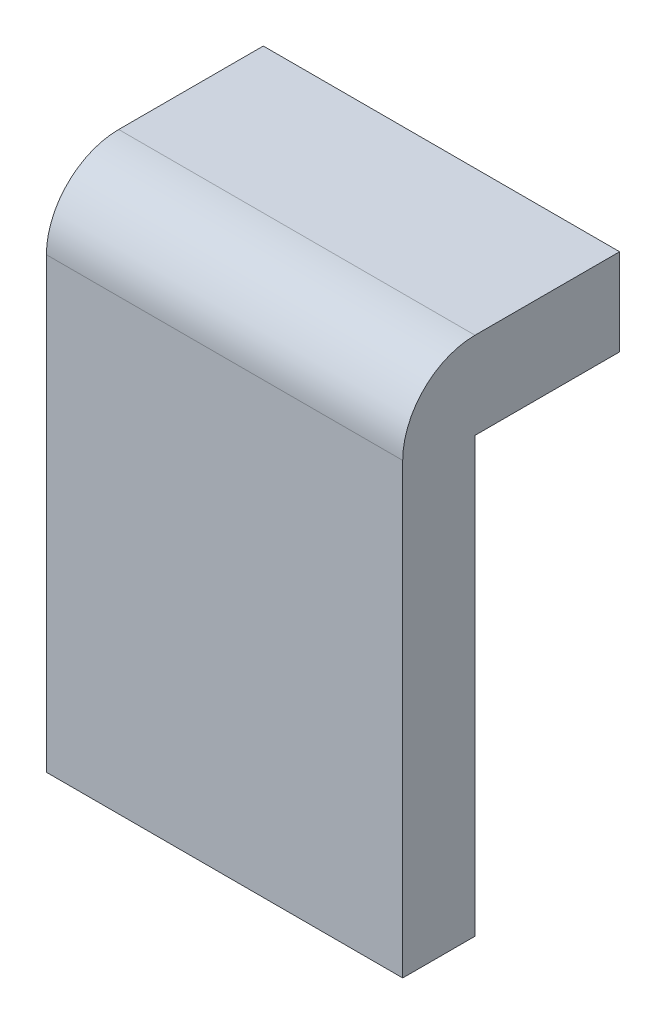
ISO-10303-21;
HEADER;
FILE_DESCRIPTION(('STEP AP214'),'2;1');
FILE_NAME('part.step','',(''),(''),'','','');
FILE_SCHEMA(('AUTOMOTIVE_DESIGN { 1 0 10303 214 1 1 1 1 }'));
ENDSEC;
DATA;
#1=APPLICATION_CONTEXT('core data for automotive mechanical design processes');
#2=APPLICATION_PROTOCOL_DEFINITION('international standard','automotive_design',2000,#1);
#3=PRODUCT_CONTEXT('',#1,'mechanical');
#4=PRODUCT('Part','Part','',(#3));
#5=PRODUCT_RELATED_PRODUCT_CATEGORY('part','',(#4));
#6=PRODUCT_DEFINITION_FORMATION('','',#4);
#7=PRODUCT_DEFINITION_CONTEXT('part definition',#1,'design');
#8=PRODUCT_DEFINITION('design','',#6,#7);
#9=PRODUCT_DEFINITION_SHAPE('','',#8);
#10=(LENGTH_UNIT() NAMED_UNIT(*) SI_UNIT(.MILLI.,.METRE.));
#11=(NAMED_UNIT(*) PLANE_ANGLE_UNIT() SI_UNIT($,.RADIAN.));
#12=(NAMED_UNIT(*) SI_UNIT($,.STERADIAN.) SOLID_ANGLE_UNIT());
#13=UNCERTAINTY_MEASURE_WITH_UNIT(LENGTH_MEASURE(1.E-05),#10,'distance_accuracy_value','');
#14=(GEOMETRIC_REPRESENTATION_CONTEXT(3) GLOBAL_UNCERTAINTY_ASSIGNED_CONTEXT((#13)) GLOBAL_UNIT_ASSIGNED_CONTEXT((#10,
#11,#12)) REPRESENTATION_CONTEXT('',''));
#15=CARTESIAN_POINT('',(0.,0.,0.));
#16=DIRECTION('',(0.,0.,1.));
#17=DIRECTION('',(1.,0.,0.));
#18=AXIS2_PLACEMENT_3D('',#15,#16,#17);
#19=CARTESIAN_POINT('',(-8.34906661620967,8.30000000000001,12.2546737770755));
#20=DIRECTION('',(0.,0.,1.));
#21=DIRECTION('',(0.,-1.,0.));
#22=AXIS2_PLACEMENT_3D('',#19,#20,#21);
#23=PLANE('',#22);
#24=DIRECTION('',(1.,0.,0.));
#25=VECTOR('',#24,1.);
#26=CARTESIAN_POINT('',(-15.8147962412963,6.80000000000003,12.2546737770755));
#27=LINE('',#26,#25);
#28=CARTESIAN_POINT('',(-5.89065244584898,6.80000000000003,12.2546737770755));
#29=VERTEX_POINT('',#28);
#30=CARTESIAN_POINT('',(-4.65850168940825,6.80000000000003,12.2546737770755));
#31=VERTEX_POINT('',#30);
#32=EDGE_CURVE('E113',#29,#31,#27,.T.);
#33=ORIENTED_EDGE('',*,*,#32,.F.);
#34=DIRECTION('',(0.,1.,0.));
#35=VECTOR('',#34,1.);
#36=CARTESIAN_POINT('',(-5.89065244584898,5.35753839337147,12.2546737770755));
#37=LINE('',#36,#35);
#38=CARTESIAN_POINT('',(-5.89065244584898,8.30000000000001,12.2546737770755));
#39=VERTEX_POINT('',#38);
#40=EDGE_CURVE('E148',#39,#29,#37,.F.);
#41=ORIENTED_EDGE('',*,*,#40,.F.);
#42=DIRECTION('',(1.,0.,0.));
#43=VECTOR('',#42,1.);
#44=CARTESIAN_POINT('',(-8.34906661620967,8.30000000000001,12.2546737770755));
#45=LINE('',#44,#43);
#46=CARTESIAN_POINT('',(-4.65850168940825,8.30000000000001,12.2546737770755));
#47=VERTEX_POINT('',#46);
#48=EDGE_CURVE('E133',#39,#47,#45,.T.);
#49=ORIENTED_EDGE('',*,*,#48,.T.);
#50=DIRECTION('',(0.,1.,0.));
#51=VECTOR('',#50,1.);
#52=CARTESIAN_POINT('',(-4.65850168940825,5.35753839337147,12.2546737770755));
#53=LINE('',#52,#51);
#54=EDGE_CURVE('E105',#31,#47,#53,.T.);
#55=ORIENTED_EDGE('',*,*,#54,.F.);
#56=EDGE_LOOP('',(#33,#41,#49,#55));
#57=FACE_BOUND('',#56,.T.);
#58=ADVANCED_FACE('F17',(#57),#23,.F.);
#59=CARTESIAN_POINT('',(-8.34906661620967,8.30000000000001,11.7546737770755));
#60=DIRECTION('',(0.,1.,0.));
#61=DIRECTION('',(0.,0.,1.));
#62=AXIS2_PLACEMENT_3D('',#59,#60,#61);
#63=PLANE('',#62);
#64=ORIENTED_EDGE('',*,*,#48,.F.);
#65=DIRECTION('',(0.,0.,1.));
#66=VECTOR('',#65,1.);
#67=CARTESIAN_POINT('',(-5.89065244584898,8.30000000000001,12.5046737770755));
#68=LINE('',#67,#66);
#69=CARTESIAN_POINT('',(-5.89065244584898,8.30000000000001,11.7546737770755));
#70=VERTEX_POINT('',#69);
#71=EDGE_CURVE('E153',#70,#39,#68,.T.);
#72=ORIENTED_EDGE('',*,*,#71,.F.);
#73=DIRECTION('',(1.,0.,0.));
#74=VECTOR('',#73,1.);
#75=CARTESIAN_POINT('',(-5.89065244584898,8.30000000000001,11.7546737770755));
#76=LINE('',#75,#74);
#77=CARTESIAN_POINT('',(-4.65850168940825,8.30000000000001,11.7546737770755));
#78=VERTEX_POINT('',#77);
#79=EDGE_CURVE('E124',#78,#70,#76,.F.);
#80=ORIENTED_EDGE('',*,*,#79,.F.);
#81=DIRECTION('',(0.,0.,-1.));
#82=VECTOR('',#81,1.);
#83=CARTESIAN_POINT('',(-4.65850168940825,8.30000000000001,12.5046737770755));
#84=LINE('',#83,#82);
#85=EDGE_CURVE('E129',#47,#78,#84,.T.);
#86=ORIENTED_EDGE('',*,*,#85,.F.);
#87=EDGE_LOOP('',(#64,#72,#80,#86));
#88=FACE_BOUND('',#87,.T.);
#89=ADVANCED_FACE('F175',(#88),#63,.F.);
#90=CARTESIAN_POINT('',(-5.89065244584898,5.35753839337146,11.7546737770755));
#91=DIRECTION('',(0.,0.,-1.));
#92=DIRECTION('',(0.,1.,0.));
#93=AXIS2_PLACEMENT_3D('',#90,#91,#92);
#94=PLANE('',#93);
#95=ORIENTED_EDGE('',*,*,#79,.T.);
#96=DIRECTION('',(0.,1.,0.));
#97=VECTOR('',#96,1.);
#98=CARTESIAN_POINT('',(-5.89065244584898,5.35753839337147,11.7546737770755));
#99=LINE('',#98,#97);
#100=CARTESIAN_POINT('',(-5.89065244584898,8.6,11.7546737770755));
#101=VERTEX_POINT('',#100);
#102=EDGE_CURVE('E119',#101,#70,#99,.F.);
#103=ORIENTED_EDGE('',*,*,#102,.F.);
#104=DIRECTION('',(1.,0.,0.));
#105=VECTOR('',#104,1.);
#106=CARTESIAN_POINT('',(-8.34906661620967,8.6,11.7546737770755));
#107=LINE('',#106,#105);
#108=CARTESIAN_POINT('',(-4.65850168940825,8.6,11.7546737770755));
#109=VERTEX_POINT('',#108);
#110=EDGE_CURVE('E122',#101,#109,#107,.T.);
#111=ORIENTED_EDGE('',*,*,#110,.T.);
#112=DIRECTION('',(0.,1.,0.));
#113=VECTOR('',#112,1.);
#114=CARTESIAN_POINT('',(-4.65850168940825,5.35753839337147,11.7546737770755));
#115=LINE('',#114,#113);
#116=EDGE_CURVE('E97',#78,#109,#115,.T.);
#117=ORIENTED_EDGE('',*,*,#116,.F.);
#118=EDGE_LOOP('',(#95,#103,#111,#117));
#119=FACE_BOUND('',#118,.T.);
#120=ADVANCED_FACE('F172',(#119),#94,.T.);
#121=CARTESIAN_POINT('',(-8.34906661620967,8.6,11.7546737770755));
#122=DIRECTION('',(0.,-1.,0.));
#123=DIRECTION('',(0.,0.,-1.));
#124=AXIS2_PLACEMENT_3D('',#121,#122,#123);
#125=PLANE('',#124);
#126=ORIENTED_EDGE('',*,*,#110,.F.);
#127=DIRECTION('',(0.,0.,1.));
#128=VECTOR('',#127,1.);
#129=CARTESIAN_POINT('',(-5.89065244584898,8.6,12.5046737770755));
#130=LINE('',#129,#128);
#131=CARTESIAN_POINT('',(-5.89065244584898,8.6,12.2546737770755));
#132=VERTEX_POINT('',#131);
#133=EDGE_CURVE('E83',#132,#101,#130,.F.);
#134=ORIENTED_EDGE('',*,*,#133,.F.);
#135=DIRECTION('',(1.,0.,0.));
#136=VECTOR('',#135,1.);
#137=CARTESIAN_POINT('',(-8.34906661620967,8.6,12.2546737770755));
#138=LINE('',#137,#136);
#139=CARTESIAN_POINT('',(-4.65850168940825,8.6,12.2546737770755));
#140=VERTEX_POINT('',#139);
#141=EDGE_CURVE('E79',#140,#132,#138,.F.);
#142=ORIENTED_EDGE('',*,*,#141,.F.);
#143=DIRECTION('',(0.,0.,-1.));
#144=VECTOR('',#143,1.);
#145=CARTESIAN_POINT('',(-4.65850168940825,8.6,12.5046737770755));
#146=LINE('',#145,#144);
#147=EDGE_CURVE('E94',#109,#140,#146,.F.);
#148=ORIENTED_EDGE('',*,*,#147,.F.);
#149=EDGE_LOOP('',(#126,#134,#142,#148));
#150=FACE_BOUND('',#149,.T.);
#151=ADVANCED_FACE('F168',(#150),#125,.F.);
#152=CARTESIAN_POINT('',(-8.34906661620967,8.35,12.2546737770755));
#153=DIRECTION('',(1.,0.,0.));
#154=DIRECTION('',(0.,0.,-1.));
#155=AXIS2_PLACEMENT_3D('',#152,#153,#154);
#156=CYLINDRICAL_SURFACE('',#155,0.249999999999995);
#157=CARTESIAN_POINT('',(-5.89065244584898,8.35,12.2546737770755));
#158=DIRECTION('',(1.,0.,0.));
#159=DIRECTION('',(0.,0.,-1.));
#160=AXIS2_PLACEMENT_3D('',#157,#158,#159);
#161=CIRCLE('',#160,0.249999999999995);
#162=CARTESIAN_POINT('',(-5.89065244584898,8.35,12.5046737770755));
#163=VERTEX_POINT('',#162);
#164=EDGE_CURVE('E20',#163,#132,#161,.F.);
#165=ORIENTED_EDGE('',*,*,#164,.F.);
#166=DIRECTION('',(1.,0.,0.));
#167=VECTOR('',#166,1.);
#168=CARTESIAN_POINT('',(-5.89065244584898,8.35,12.5046737770755));
#169=LINE('',#168,#167);
#170=CARTESIAN_POINT('',(-4.65850168940825,8.35,12.5046737770755));
#171=VERTEX_POINT('',#170);
#172=EDGE_CURVE('E77',#171,#163,#169,.F.);
#173=ORIENTED_EDGE('',*,*,#172,.F.);
#174=CARTESIAN_POINT('',(-4.65850168940825,8.35,12.2546737770755));
#175=DIRECTION('',(1.,0.,0.));
#176=DIRECTION('',(0.,0.,-1.));
#177=AXIS2_PLACEMENT_3D('',#174,#175,#176);
#178=CIRCLE('',#177,0.249999999999995);
#179=EDGE_CURVE('E106',#140,#171,#178,.T.);
#180=ORIENTED_EDGE('',*,*,#179,.F.);
#181=ORIENTED_EDGE('',*,*,#141,.T.);
#182=EDGE_LOOP('',(#165,#173,#180,#181));
#183=FACE_BOUND('',#182,.T.);
#184=ADVANCED_FACE('F74',(#183),#156,.T.);
#185=CARTESIAN_POINT('',(-5.89065244584898,5.35753839337147,12.5046737770755));
#186=DIRECTION('',(-1.,0.,0.));
#187=DIRECTION('',(0.,0.,1.));
#188=AXIS2_PLACEMENT_3D('',#185,#186,#187);
#189=PLANE('',#188);
#190=DIRECTION('',(0.,0.,-1.));
#191=VECTOR('',#190,1.);
#192=CARTESIAN_POINT('',(-5.89065244584898,6.80000000000003,12.5046737770755));
#193=LINE('',#192,#191);
#194=CARTESIAN_POINT('',(-5.89065244584898,6.80000000000003,12.5046737770755));
#195=VERTEX_POINT('',#194);
#196=EDGE_CURVE('E89',#195,#29,#193,.T.);
#197=ORIENTED_EDGE('',*,*,#196,.F.);
#198=DIRECTION('',(0.,-1.,0.));
#199=VECTOR('',#198,1.);
#200=CARTESIAN_POINT('',(-5.89065244584898,5.35753839337147,12.5046737770755));
#201=LINE('',#200,#199);
#202=EDGE_CURVE('E85',#163,#195,#201,.T.);
#203=ORIENTED_EDGE('',*,*,#202,.F.);
#204=ORIENTED_EDGE('',*,*,#164,.T.);
#205=ORIENTED_EDGE('',*,*,#133,.T.);
#206=ORIENTED_EDGE('',*,*,#102,.T.);
#207=ORIENTED_EDGE('',*,*,#71,.T.);
#208=ORIENTED_EDGE('',*,*,#40,.T.);
#209=EDGE_LOOP('',(#197,#203,#204,#205,#206,#207,#208));
#210=FACE_BOUND('',#209,.T.);
#211=ADVANCED_FACE('F86',(#210),#189,.T.);
#212=CARTESIAN_POINT('',(-15.8147962412963,6.80000000000003,12.5046737770755));
#213=DIRECTION('',(0.,-1.,0.));
#214=DIRECTION('',(0.,0.,-1.));
#215=AXIS2_PLACEMENT_3D('',#212,#213,#214);
#216=PLANE('',#215);
#217=DIRECTION('',(1.,0.,0.));
#218=VECTOR('',#217,1.);
#219=CARTESIAN_POINT('',(-5.89065244584898,6.80000000000003,12.5046737770755));
#220=LINE('',#219,#218);
#221=CARTESIAN_POINT('',(-4.65850168940825,6.80000000000003,12.5046737770755));
#222=VERTEX_POINT('',#221);
#223=EDGE_CURVE('E26',#195,#222,#220,.T.);
#224=ORIENTED_EDGE('',*,*,#223,.F.);
#225=ORIENTED_EDGE('',*,*,#196,.T.);
#226=ORIENTED_EDGE('',*,*,#32,.T.);
#227=DIRECTION('',(0.,0.,-1.));
#228=VECTOR('',#227,1.);
#229=CARTESIAN_POINT('',(-4.65850168940825,6.80000000000003,12.5046737770755));
#230=LINE('',#229,#228);
#231=EDGE_CURVE('E35',#222,#31,#230,.T.);
#232=ORIENTED_EDGE('',*,*,#231,.F.);
#233=EDGE_LOOP('',(#224,#225,#226,#232));
#234=FACE_BOUND('',#233,.T.);
#235=ADVANCED_FACE('F179',(#234),#216,.T.);
#236=CARTESIAN_POINT('',(-4.65850168940825,5.35753839337147,12.5046737770755));
#237=DIRECTION('',(1.,0.,0.));
#238=DIRECTION('',(0.,0.,-1.));
#239=AXIS2_PLACEMENT_3D('',#236,#237,#238);
#240=PLANE('',#239);
#241=ORIENTED_EDGE('',*,*,#116,.T.);
#242=ORIENTED_EDGE('',*,*,#147,.T.);
#243=ORIENTED_EDGE('',*,*,#179,.T.);
#244=DIRECTION('',(0.,-1.,0.));
#245=VECTOR('',#244,1.);
#246=CARTESIAN_POINT('',(-4.65850168940825,5.35753839337147,12.5046737770755));
#247=LINE('',#246,#245);
#248=EDGE_CURVE('E11',#222,#171,#247,.F.);
#249=ORIENTED_EDGE('',*,*,#248,.F.);
#250=ORIENTED_EDGE('',*,*,#231,.T.);
#251=ORIENTED_EDGE('',*,*,#54,.T.);
#252=ORIENTED_EDGE('',*,*,#85,.T.);
#253=EDGE_LOOP('',(#241,#242,#243,#249,#250,#251,#252));
#254=FACE_BOUND('',#253,.T.);
#255=ADVANCED_FACE('F164',(#254),#240,.T.);
#256=CARTESIAN_POINT('',(-5.89065244584898,5.35753839337147,12.5046737770755));
#257=DIRECTION('',(0.,0.,1.));
#258=DIRECTION('',(0.,-1.,0.));
#259=AXIS2_PLACEMENT_3D('',#256,#257,#258);
#260=PLANE('',#259);
#261=ORIENTED_EDGE('',*,*,#223,.T.);
#262=ORIENTED_EDGE('',*,*,#248,.T.);
#263=ORIENTED_EDGE('',*,*,#172,.T.);
#264=ORIENTED_EDGE('',*,*,#202,.T.);
#265=EDGE_LOOP('',(#261,#262,#263,#264));
#266=FACE_BOUND('',#265,.T.);
#267=ADVANCED_FACE('F93',(#266),#260,.T.);
#268=CLOSED_SHELL('',(#58,#89,#120,#151,#184,#211,#235,#255,#267));
#269=MANIFOLD_SOLID_BREP('B1',#268);
#270=ADVANCED_BREP_SHAPE_REPRESENTATION('',(#18,#269),#14);
#271=SHAPE_DEFINITION_REPRESENTATION(#9,#270);
ENDSEC;
END-ISO-10303-21;
